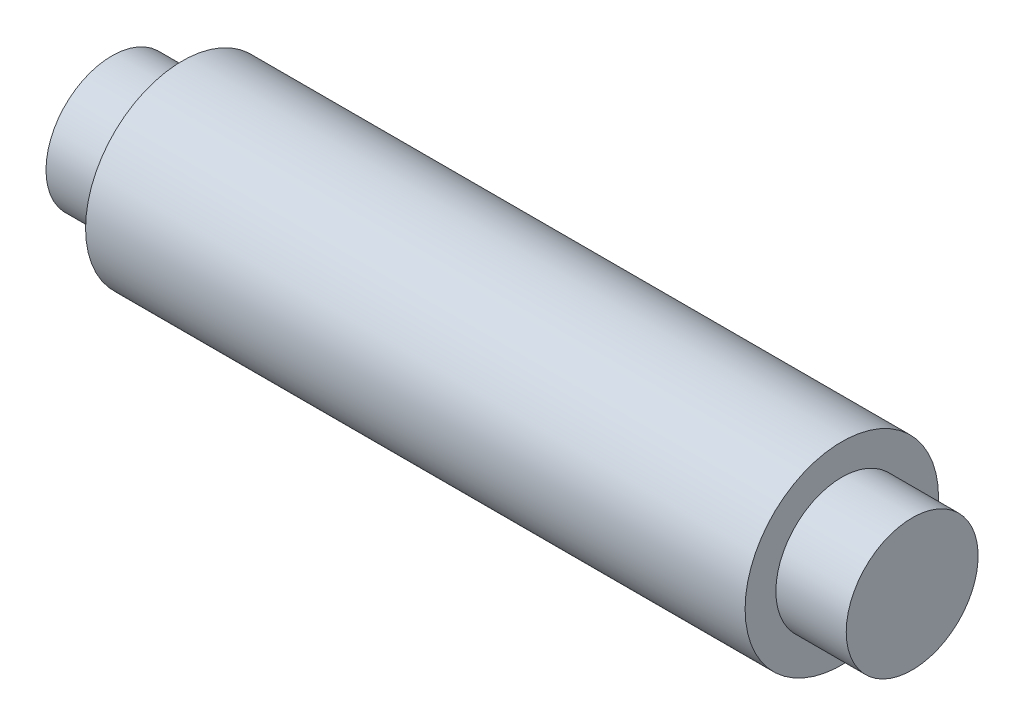
ISO-10303-21;
HEADER;
FILE_DESCRIPTION(('STEP AP214'),'2;1');
FILE_NAME('part.step','',(''),(''),'','','');
FILE_SCHEMA(('AUTOMOTIVE_DESIGN { 1 0 10303 214 1 1 1 1 }'));
ENDSEC;
DATA;
#1=APPLICATION_CONTEXT('core data for automotive mechanical design processes');
#2=APPLICATION_PROTOCOL_DEFINITION('international standard','automotive_design',2000,#1);
#3=PRODUCT_CONTEXT('',#1,'mechanical');
#4=PRODUCT('Part','Part','',(#3));
#5=PRODUCT_RELATED_PRODUCT_CATEGORY('part','',(#4));
#6=PRODUCT_DEFINITION_FORMATION('','',#4);
#7=PRODUCT_DEFINITION_CONTEXT('part definition',#1,'design');
#8=PRODUCT_DEFINITION('design','',#6,#7);
#9=PRODUCT_DEFINITION_SHAPE('','',#8);
#10=(LENGTH_UNIT() NAMED_UNIT(*) SI_UNIT(.MILLI.,.METRE.));
#11=(NAMED_UNIT(*) PLANE_ANGLE_UNIT() SI_UNIT($,.RADIAN.));
#12=(NAMED_UNIT(*) SI_UNIT($,.STERADIAN.) SOLID_ANGLE_UNIT());
#13=UNCERTAINTY_MEASURE_WITH_UNIT(LENGTH_MEASURE(1.E-05),#10,'distance_accuracy_value','');
#14=(GEOMETRIC_REPRESENTATION_CONTEXT(3) GLOBAL_UNCERTAINTY_ASSIGNED_CONTEXT((#13)) GLOBAL_UNIT_ASSIGNED_CONTEXT((#10,
#11,#12)) REPRESENTATION_CONTEXT('',''));
#15=CARTESIAN_POINT('',(0.,0.,0.));
#16=DIRECTION('',(0.,0.,1.));
#17=DIRECTION('',(1.,0.,0.));
#18=AXIS2_PLACEMENT_3D('',#15,#16,#17);
#19=CARTESIAN_POINT('',(-45.5,0.,0.));
#20=DIRECTION('',(1.,0.,0.));
#21=DIRECTION('',(0.,0.,-1.));
#22=AXIS2_PLACEMENT_3D('',#19,#20,#21);
#23=PLANE('',#22);
#24=CARTESIAN_POINT('',(-45.5,0.,0.));
#25=DIRECTION('',(-1.,0.,0.));
#26=DIRECTION('',(0.,0.,1.));
#27=AXIS2_PLACEMENT_3D('',#24,#25,#26);
#28=CIRCLE('',#27,7.5);
#29=CARTESIAN_POINT('',(-45.5,0.,7.5));
#30=VERTEX_POINT('',#29);
#31=EDGE_CURVE('E10',#30,#30,#28,.T.);
#32=ORIENTED_EDGE('',*,*,#31,.T.);
#33=EDGE_LOOP('',(#32));
#34=FACE_BOUND('',#33,.T.);
#35=ADVANCED_FACE('F37',(#34),#23,.F.);
#36=CARTESIAN_POINT('',(-45.5,0.,0.));
#37=DIRECTION('',(-1.,0.,0.));
#38=DIRECTION('',(0.,0.,1.));
#39=AXIS2_PLACEMENT_3D('',#36,#37,#38);
#40=CYLINDRICAL_SURFACE('',#39,7.5);
#41=ORIENTED_EDGE('',*,*,#31,.F.);
#42=EDGE_LOOP('',(#41));
#43=FACE_BOUND('',#42,.T.);
#44=CARTESIAN_POINT('',(-37.5,0.,0.));
#45=DIRECTION('',(-1.,0.,0.));
#46=DIRECTION('',(0.,0.,1.));
#47=AXIS2_PLACEMENT_3D('',#44,#45,#46);
#48=CIRCLE('',#47,7.5);
#49=CARTESIAN_POINT('',(-37.5,0.,7.5));
#50=VERTEX_POINT('',#49);
#51=EDGE_CURVE('E44',#50,#50,#48,.T.);
#52=ORIENTED_EDGE('',*,*,#51,.T.);
#53=EDGE_LOOP('',(#52));
#54=FACE_BOUND('',#53,.T.);
#55=ADVANCED_FACE('F81',(#43,#54),#40,.T.);
#56=CARTESIAN_POINT('',(-37.5,7.5,0.));
#57=DIRECTION('',(1.,0.,0.));
#58=DIRECTION('',(0.,0.,-1.));
#59=AXIS2_PLACEMENT_3D('',#56,#57,#58);
#60=PLANE('',#59);
#61=ORIENTED_EDGE('',*,*,#51,.F.);
#62=EDGE_LOOP('',(#61));
#63=FACE_BOUND('',#62,.T.);
#64=CARTESIAN_POINT('',(-37.5,0.,0.));
#65=DIRECTION('',(-1.,0.,0.));
#66=DIRECTION('',(0.,0.,1.));
#67=AXIS2_PLACEMENT_3D('',#64,#65,#66);
#68=CIRCLE('',#67,11.);
#69=CARTESIAN_POINT('',(-37.5,0.,11.));
#70=VERTEX_POINT('',#69);
#71=EDGE_CURVE('E49',#70,#70,#68,.T.);
#72=ORIENTED_EDGE('',*,*,#71,.T.);
#73=EDGE_LOOP('',(#72));
#74=FACE_BOUND('',#73,.T.);
#75=ADVANCED_FACE('F85',(#63,#74),#60,.F.);
#76=CARTESIAN_POINT('',(-45.5,0.,0.));
#77=DIRECTION('',(-1.,0.,0.));
#78=DIRECTION('',(0.,0.,1.));
#79=AXIS2_PLACEMENT_3D('',#76,#77,#78);
#80=CYLINDRICAL_SURFACE('',#79,11.);
#81=ORIENTED_EDGE('',*,*,#71,.F.);
#82=EDGE_LOOP('',(#81));
#83=FACE_BOUND('',#82,.T.);
#84=CARTESIAN_POINT('',(37.5,0.,0.));
#85=DIRECTION('',(-1.,0.,0.));
#86=DIRECTION('',(0.,0.,1.));
#87=AXIS2_PLACEMENT_3D('',#84,#85,#86);
#88=CIRCLE('',#87,11.);
#89=CARTESIAN_POINT('',(37.5,0.,11.));
#90=VERTEX_POINT('',#89);
#91=EDGE_CURVE('E54',#90,#90,#88,.T.);
#92=ORIENTED_EDGE('',*,*,#91,.T.);
#93=EDGE_LOOP('',(#92));
#94=FACE_BOUND('',#93,.T.);
#95=ADVANCED_FACE('F90',(#83,#94),#80,.T.);
#96=CARTESIAN_POINT('',(37.5,11.,0.));
#97=DIRECTION('',(-1.,0.,0.));
#98=DIRECTION('',(0.,0.,1.));
#99=AXIS2_PLACEMENT_3D('',#96,#97,#98);
#100=PLANE('',#99);
#101=ORIENTED_EDGE('',*,*,#91,.F.);
#102=EDGE_LOOP('',(#101));
#103=FACE_BOUND('',#102,.T.);
#104=CARTESIAN_POINT('',(37.5,0.,0.));
#105=DIRECTION('',(-1.,0.,0.));
#106=DIRECTION('',(0.,0.,1.));
#107=AXIS2_PLACEMENT_3D('',#104,#105,#106);
#108=CIRCLE('',#107,7.5);
#109=CARTESIAN_POINT('',(37.5,0.,7.5));
#110=VERTEX_POINT('',#109);
#111=EDGE_CURVE('E60',#110,#110,#108,.T.);
#112=ORIENTED_EDGE('',*,*,#111,.T.);
#113=EDGE_LOOP('',(#112));
#114=FACE_BOUND('',#113,.T.);
#115=ADVANCED_FACE('F77',(#103,#114),#100,.F.);
#116=CARTESIAN_POINT('',(-45.5,0.,0.));
#117=DIRECTION('',(-1.,0.,0.));
#118=DIRECTION('',(0.,0.,1.));
#119=AXIS2_PLACEMENT_3D('',#116,#117,#118);
#120=CYLINDRICAL_SURFACE('',#119,7.5);
#121=ORIENTED_EDGE('',*,*,#111,.F.);
#122=EDGE_LOOP('',(#121));
#123=FACE_BOUND('',#122,.T.);
#124=CARTESIAN_POINT('',(45.5,0.,0.));
#125=DIRECTION('',(-1.,0.,0.));
#126=DIRECTION('',(0.,0.,1.));
#127=AXIS2_PLACEMENT_3D('',#124,#125,#126);
#128=CIRCLE('',#127,7.5);
#129=CARTESIAN_POINT('',(45.5,0.,7.5));
#130=VERTEX_POINT('',#129);
#131=EDGE_CURVE('E64',#130,#130,#128,.T.);
#132=ORIENTED_EDGE('',*,*,#131,.T.);
#133=EDGE_LOOP('',(#132));
#134=FACE_BOUND('',#133,.T.);
#135=ADVANCED_FACE('F69',(#123,#134),#120,.T.);
#136=CARTESIAN_POINT('',(45.5,7.5,0.));
#137=DIRECTION('',(-1.,0.,0.));
#138=DIRECTION('',(0.,0.,1.));
#139=AXIS2_PLACEMENT_3D('',#136,#137,#138);
#140=PLANE('',#139);
#141=ORIENTED_EDGE('',*,*,#131,.F.);
#142=EDGE_LOOP('',(#141));
#143=FACE_BOUND('',#142,.T.);
#144=ADVANCED_FACE('F71',(#143),#140,.F.);
#145=CLOSED_SHELL('',(#35,#55,#75,#95,#115,#135,#144));
#146=MANIFOLD_SOLID_BREP('B2',#145);
#147=ADVANCED_BREP_SHAPE_REPRESENTATION('',(#18,#146),#14);
#148=SHAPE_DEFINITION_REPRESENTATION(#9,#147);
ENDSEC;
END-ISO-10303-21;
